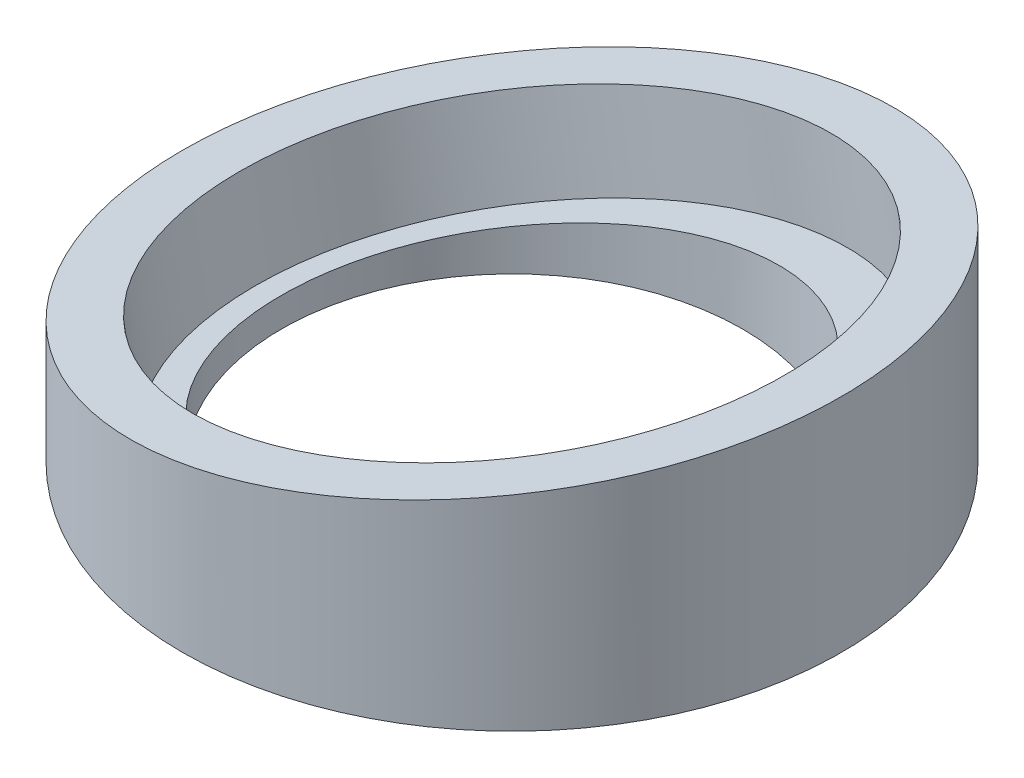
ISO-10303-21;
HEADER;
FILE_DESCRIPTION(('STEP AP214'),'2;1');
FILE_NAME('part.step','',(''),(''),'','','');
FILE_SCHEMA(('AUTOMOTIVE_DESIGN { 1 0 10303 214 1 1 1 1 }'));
ENDSEC;
DATA;
#1=APPLICATION_CONTEXT('core data for automotive mechanical design processes');
#2=APPLICATION_PROTOCOL_DEFINITION('international standard','automotive_design',2000,#1);
#3=PRODUCT_CONTEXT('',#1,'mechanical');
#4=PRODUCT('Part','Part','',(#3));
#5=PRODUCT_RELATED_PRODUCT_CATEGORY('part','',(#4));
#6=PRODUCT_DEFINITION_FORMATION('','',#4);
#7=PRODUCT_DEFINITION_CONTEXT('part definition',#1,'design');
#8=PRODUCT_DEFINITION('design','',#6,#7);
#9=PRODUCT_DEFINITION_SHAPE('','',#8);
#10=(LENGTH_UNIT() NAMED_UNIT(*) SI_UNIT(.MILLI.,.METRE.));
#11=(NAMED_UNIT(*) PLANE_ANGLE_UNIT() SI_UNIT($,.RADIAN.));
#12=(NAMED_UNIT(*) SI_UNIT($,.STERADIAN.) SOLID_ANGLE_UNIT());
#13=UNCERTAINTY_MEASURE_WITH_UNIT(LENGTH_MEASURE(1.E-05),#10,'distance_accuracy_value','');
#14=(GEOMETRIC_REPRESENTATION_CONTEXT(3) GLOBAL_UNCERTAINTY_ASSIGNED_CONTEXT((#13)) GLOBAL_UNIT_ASSIGNED_CONTEXT((#10,
#11,#12)) REPRESENTATION_CONTEXT('',''));
#15=CARTESIAN_POINT('',(0.,0.,0.));
#16=DIRECTION('',(0.,0.,1.));
#17=DIRECTION('',(1.,0.,0.));
#18=AXIS2_PLACEMENT_3D('',#15,#16,#17);
#19=CARTESIAN_POINT('',(0.,0.,0.));
#20=DIRECTION('',(0.,1.,0.));
#21=DIRECTION('',(0.,0.,1.));
#22=AXIS2_PLACEMENT_3D('',#19,#20,#21);
#23=CYLINDRICAL_SURFACE('',#22,17.5);
#24=CARTESIAN_POINT('',(0.,0.,0.));
#25=DIRECTION('',(0.,1.,0.));
#26=DIRECTION('',(0.,0.,1.));
#27=AXIS2_PLACEMENT_3D('',#24,#25,#26);
#28=CIRCLE('',#27,17.5);
#29=CARTESIAN_POINT('',(0.,0.,17.5));
#30=VERTEX_POINT('',#29);
#31=EDGE_CURVE('E46',#30,#30,#28,.T.);
#32=ORIENTED_EDGE('',*,*,#31,.F.);
#33=EDGE_LOOP('',(#32));
#34=FACE_BOUND('',#33,.T.);
#35=CARTESIAN_POINT('',(0.,5.30018823451144,0.));
#36=DIRECTION('',(-0.173648177666931,0.984807753012208,0.));
#37=DIRECTION('',(0.984807753012208,0.173648177666931,0.));
#38=AXIS2_PLACEMENT_3D('',#35,#36,#37);
#39=ELLIPSE('',#38,17.7699657080005,17.5);
#40=CARTESIAN_POINT('',(17.5,8.38591039690959,0.));
#41=VERTEX_POINT('',#40);
#42=EDGE_CURVE('E41',#41,#41,#39,.F.);
#43=ORIENTED_EDGE('',*,*,#42,.F.);
#44=EDGE_LOOP('',(#43));
#45=FACE_BOUND('',#44,.T.);
#46=ADVANCED_FACE('F37',(#34,#45),#23,.F.);
#47=CARTESIAN_POINT('',(0.,20.,0.));
#48=DIRECTION('',(0.,-1.,0.));
#49=DIRECTION('',(0.,0.,-1.));
#50=AXIS2_PLACEMENT_3D('',#47,#48,#49);
#51=CYLINDRICAL_SURFACE('',#50,25.);
#52=CARTESIAN_POINT('',(0.,12.4081745177116,0.));
#53=DIRECTION('',(0.173648177666931,-0.984807753012208,0.));
#54=DIRECTION('',(-0.984807753012208,-0.173648177666931,0.));
#55=AXIS2_PLACEMENT_3D('',#52,#53,#54);
#56=ELLIPSE('',#55,25.3856652971436,25.);
#57=CARTESIAN_POINT('',(-25.,8.,0.));
#58=VERTEX_POINT('',#57);
#59=EDGE_CURVE('E51',#58,#58,#56,.T.);
#60=ORIENTED_EDGE('',*,*,#59,.T.);
#61=EDGE_LOOP('',(#60));
#62=FACE_BOUND('',#61,.T.);
#63=CARTESIAN_POINT('',(0.,0.,0.));
#64=DIRECTION('',(0.,1.,0.));
#65=DIRECTION('',(0.,0.,1.));
#66=AXIS2_PLACEMENT_3D('',#63,#64,#65);
#67=CIRCLE('',#66,25.);
#68=CARTESIAN_POINT('',(0.,0.,25.));
#69=VERTEX_POINT('',#68);
#70=EDGE_CURVE('E10',#69,#69,#67,.T.);
#71=ORIENTED_EDGE('',*,*,#70,.T.);
#72=EDGE_LOOP('',(#71));
#73=FACE_BOUND('',#72,.T.);
#74=ADVANCED_FACE('F39',(#62,#73),#51,.T.);
#75=CARTESIAN_POINT('',(0.,0.,0.));
#76=DIRECTION('',(0.,1.,0.));
#77=DIRECTION('',(0.,0.,1.));
#78=AXIS2_PLACEMENT_3D('',#75,#76,#77);
#79=PLANE('',#78);
#80=ORIENTED_EDGE('',*,*,#31,.T.);
#81=EDGE_LOOP('',(#80));
#82=FACE_BOUND('',#81,.T.);
#83=ORIENTED_EDGE('',*,*,#70,.F.);
#84=EDGE_LOOP('',(#83));
#85=FACE_BOUND('',#84,.T.);
#86=ADVANCED_FACE('F78',(#82,#85),#79,.F.);
#87=CARTESIAN_POINT('',(-25.,8.,-38.5));
#88=DIRECTION('',(0.173648177666931,-0.984807753012208,0.));
#89=DIRECTION('',(0.984807753012208,0.173648177666931,0.));
#90=AXIS2_PLACEMENT_3D('',#87,#88,#89);
#91=PLANE('',#90);
#92=CARTESIAN_POINT('',(0.,12.4081745177117,0.));
#93=DIRECTION('',(-0.173648177666931,0.984807753012208,0.));
#94=DIRECTION('',(-0.984807753012208,-0.173648177666931,0.));
#95=AXIS2_PLACEMENT_3D('',#92,#93,#94);
#96=CIRCLE('',#95,21.);
#97=CARTESIAN_POINT('',(-20.6809628132564,8.76156278670609,0.));
#98=VERTEX_POINT('',#97);
#99=EDGE_CURVE('E57',#98,#98,#96,.T.);
#100=ORIENTED_EDGE('',*,*,#99,.F.);
#101=EDGE_LOOP('',(#100));
#102=FACE_BOUND('',#101,.T.);
#103=ORIENTED_EDGE('',*,*,#59,.F.);
#104=EDGE_LOOP('',(#103));
#105=FACE_BOUND('',#104,.T.);
#106=ADVANCED_FACE('F82',(#102,#105),#91,.F.);
#107=CARTESIAN_POINT('',(1.21553724366852,5.5145202466262,0.));
#108=DIRECTION('',(-0.173648177666931,0.984807753012208,0.));
#109=DIRECTION('',(-0.984807753012208,-0.173648177666931,0.));
#110=AXIS2_PLACEMENT_3D('',#107,#108,#109);
#111=PLANE('',#110);
#112=CARTESIAN_POINT('',(1.21553724366852,5.5145202466262,0.));
#113=DIRECTION('',(-0.173648177666931,0.984807753012208,0.));
#114=DIRECTION('',(-0.984807753012208,-0.173648177666931,0.));
#115=AXIS2_PLACEMENT_3D('',#112,#113,#114);
#116=CIRCLE('',#115,21.);
#117=CARTESIAN_POINT('',(-19.4654255695879,1.86790851562064,0.));
#118=VERTEX_POINT('',#117);
#119=EDGE_CURVE('E61',#118,#118,#116,.T.);
#120=ORIENTED_EDGE('',*,*,#119,.T.);
#121=EDGE_LOOP('',(#120));
#122=FACE_BOUND('',#121,.T.);
#123=ORIENTED_EDGE('',*,*,#42,.T.);
#124=EDGE_LOOP('',(#123));
#125=FACE_BOUND('',#124,.T.);
#126=ADVANCED_FACE('F70',(#122,#125),#111,.T.);
#127=CARTESIAN_POINT('',(1.21553724366852,5.5145202466262,0.));
#128=DIRECTION('',(-0.173648177666931,0.984807753012208,0.));
#129=DIRECTION('',(-0.984807753012208,-0.173648177666931,0.));
#130=AXIS2_PLACEMENT_3D('',#127,#128,#129);
#131=CYLINDRICAL_SURFACE('',#130,21.);
#132=ORIENTED_EDGE('',*,*,#119,.F.);
#133=EDGE_LOOP('',(#132));
#134=FACE_BOUND('',#133,.T.);
#135=ORIENTED_EDGE('',*,*,#99,.T.);
#136=EDGE_LOOP('',(#135));
#137=FACE_BOUND('',#136,.T.);
#138=ADVANCED_FACE('F94',(#134,#137),#131,.F.);
#139=CLOSED_SHELL('',(#46,#74,#86,#106,#126,#138));
#140=MANIFOLD_SOLID_BREP('B2',#139);
#141=ADVANCED_BREP_SHAPE_REPRESENTATION('',(#18,#140),#14);
#142=SHAPE_DEFINITION_REPRESENTATION(#9,#141);
ENDSEC;
END-ISO-10303-21;
